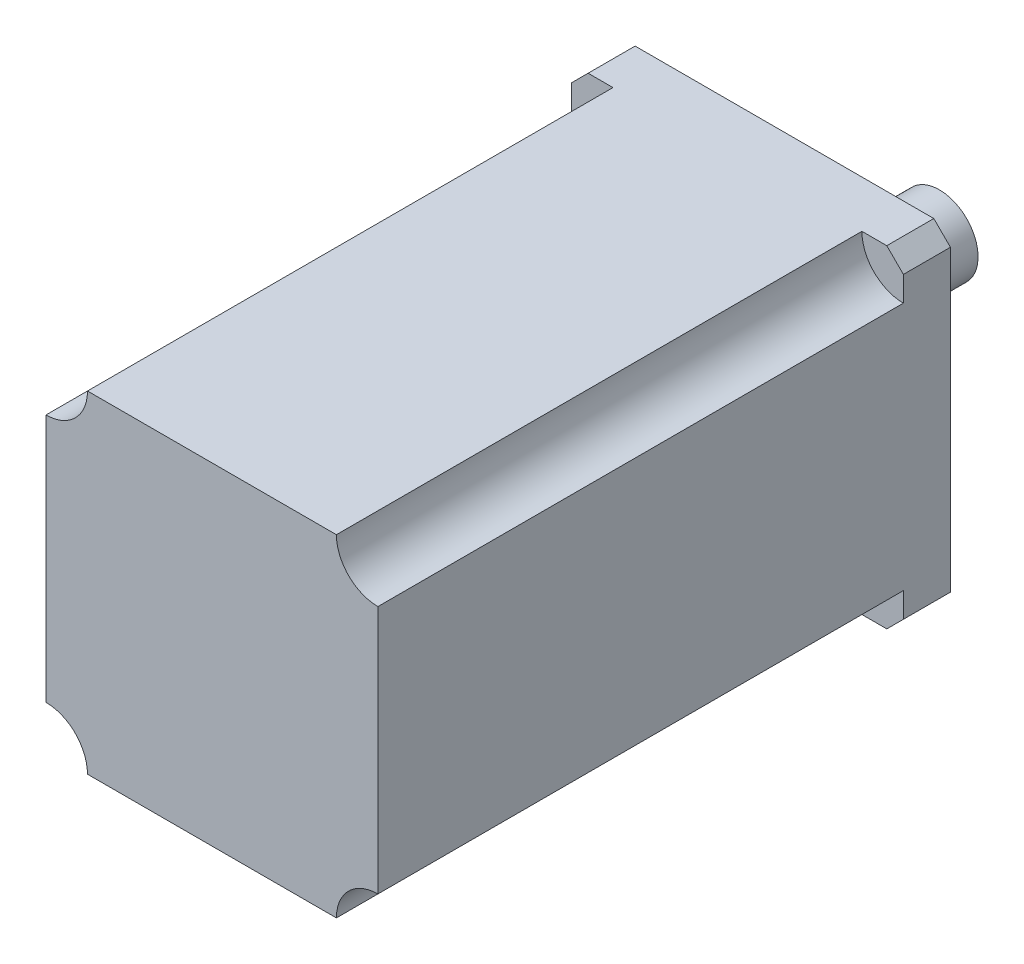
ISO-10303-21;
HEADER;
FILE_DESCRIPTION(('STEP AP214'),'2;1');
FILE_NAME('part.step','',(''),(''),'','','');
FILE_SCHEMA(('AUTOMOTIVE_DESIGN { 1 0 10303 214 1 1 1 1 }'));
ENDSEC;
DATA;
#1=APPLICATION_CONTEXT('core data for automotive mechanical design processes');
#2=APPLICATION_PROTOCOL_DEFINITION('international standard','automotive_design',2000,#1);
#3=PRODUCT_CONTEXT('',#1,'mechanical');
#4=PRODUCT('Part','Part','',(#3));
#5=PRODUCT_RELATED_PRODUCT_CATEGORY('part','',(#4));
#6=PRODUCT_DEFINITION_FORMATION('','',#4);
#7=PRODUCT_DEFINITION_CONTEXT('part definition',#1,'design');
#8=PRODUCT_DEFINITION('design','',#6,#7);
#9=PRODUCT_DEFINITION_SHAPE('','',#8);
#10=(LENGTH_UNIT() NAMED_UNIT(*) SI_UNIT(.MILLI.,.METRE.));
#11=(NAMED_UNIT(*) PLANE_ANGLE_UNIT() SI_UNIT($,.RADIAN.));
#12=(NAMED_UNIT(*) SI_UNIT($,.STERADIAN.) SOLID_ANGLE_UNIT());
#13=UNCERTAINTY_MEASURE_WITH_UNIT(LENGTH_MEASURE(1.E-05),#10,'distance_accuracy_value','');
#14=(GEOMETRIC_REPRESENTATION_CONTEXT(3) GLOBAL_UNCERTAINTY_ASSIGNED_CONTEXT((#13)) GLOBAL_UNIT_ASSIGNED_CONTEXT((#10,
#11,#12)) REPRESENTATION_CONTEXT('',''));
#15=CARTESIAN_POINT('',(0.,0.,0.));
#16=DIRECTION('',(0.,0.,1.));
#17=DIRECTION('',(1.,0.,0.));
#18=AXIS2_PLACEMENT_3D('',#15,#16,#17);
#19=CARTESIAN_POINT('',(60.,0.,95.));
#20=DIRECTION('',(0.,0.,-1.));
#21=DIRECTION('',(-1.,0.,0.));
#22=AXIS2_PLACEMENT_3D('',#19,#20,#21);
#23=CYLINDRICAL_SURFACE('',#22,7.50000000000001);
#24=CARTESIAN_POINT('',(60.,0.,0.));
#25=DIRECTION('',(0.,0.,-1.));
#26=DIRECTION('',(1.,0.,0.));
#27=AXIS2_PLACEMENT_3D('',#24,#25,#26);
#28=CIRCLE('',#27,7.50000000000001);
#29=CARTESIAN_POINT('',(60.,-7.50000000000001,0.));
#30=VERTEX_POINT('',#29);
#31=CARTESIAN_POINT('',(52.5,0.,0.));
#32=VERTEX_POINT('',#31);
#33=EDGE_CURVE('E254',#30,#32,#28,.T.);
#34=ORIENTED_EDGE('',*,*,#33,.T.);
#35=DIRECTION('',(0.,0.,-1.));
#36=VECTOR('',#35,1.);
#37=CARTESIAN_POINT('',(52.5,0.,95.));
#38=LINE('',#37,#36);
#39=CARTESIAN_POINT('',(52.5,0.,95.));
#40=VERTEX_POINT('',#39);
#41=EDGE_CURVE('E189',#40,#32,#38,.T.);
#42=ORIENTED_EDGE('',*,*,#41,.F.);
#43=CARTESIAN_POINT('',(60.,0.,95.));
#44=DIRECTION('',(0.,0.,-1.));
#45=DIRECTION('',(1.,0.,0.));
#46=AXIS2_PLACEMENT_3D('',#43,#44,#45);
#47=CIRCLE('',#46,7.50000000000001);
#48=CARTESIAN_POINT('',(60.,-7.50000000000001,95.));
#49=VERTEX_POINT('',#48);
#50=EDGE_CURVE('E261',#49,#40,#47,.T.);
#51=ORIENTED_EDGE('',*,*,#50,.F.);
#52=DIRECTION('',(0.,0.,-1.));
#53=VECTOR('',#52,1.);
#54=CARTESIAN_POINT('',(60.,-7.50000000000001,95.));
#55=LINE('',#54,#53);
#56=EDGE_CURVE('E277',#49,#30,#55,.T.);
#57=ORIENTED_EDGE('',*,*,#56,.T.);
#58=EDGE_LOOP('',(#34,#42,#51,#57));
#59=FACE_BOUND('',#58,.T.);
#60=ADVANCED_FACE('F37',(#59),#23,.F.);
#61=CARTESIAN_POINT('',(7.50000000000002,0.,95.));
#62=DIRECTION('',(0.,-1.,0.));
#63=DIRECTION('',(0.,0.,-1.));
#64=AXIS2_PLACEMENT_3D('',#61,#62,#63);
#65=PLANE('',#64);
#66=DIRECTION('',(1.,0.,0.));
#67=VECTOR('',#66,1.);
#68=CARTESIAN_POINT('',(0.,0.,-8.5));
#69=LINE('',#68,#67);
#70=CARTESIAN_POINT('',(3.00000000000001,0.,-8.5));
#71=VERTEX_POINT('',#70);
#72=CARTESIAN_POINT('',(57.,0.,-8.5));
#73=VERTEX_POINT('',#72);
#74=EDGE_CURVE('E239',#71,#73,#69,.T.);
#75=ORIENTED_EDGE('',*,*,#74,.F.);
#76=DIRECTION('',(0.,0.,1.));
#77=VECTOR('',#76,1.);
#78=CARTESIAN_POINT('',(3.00000000000001,0.,95.));
#79=LINE('',#78,#77);
#80=CARTESIAN_POINT('',(3.00000000000001,0.,0.));
#81=VERTEX_POINT('',#80);
#82=EDGE_CURVE('E221',#71,#81,#79,.T.);
#83=ORIENTED_EDGE('',*,*,#82,.T.);
#84=DIRECTION('',(1.,0.,0.));
#85=VECTOR('',#84,1.);
#86=CARTESIAN_POINT('',(0.,0.,0.));
#87=LINE('',#86,#85);
#88=CARTESIAN_POINT('',(7.50000000000002,0.,0.));
#89=VERTEX_POINT('',#88);
#90=EDGE_CURVE('E228',#81,#89,#87,.T.);
#91=ORIENTED_EDGE('',*,*,#90,.T.);
#92=DIRECTION('',(0.,0.,-1.));
#93=VECTOR('',#92,1.);
#94=CARTESIAN_POINT('',(7.50000000000002,0.,95.));
#95=LINE('',#94,#93);
#96=CARTESIAN_POINT('',(7.50000000000002,0.,95.));
#97=VERTEX_POINT('',#96);
#98=EDGE_CURVE('E181',#97,#89,#95,.T.);
#99=ORIENTED_EDGE('',*,*,#98,.F.);
#100=DIRECTION('',(-1.,0.,0.));
#101=VECTOR('',#100,1.);
#102=CARTESIAN_POINT('',(7.50000000000002,0.,95.));
#103=LINE('',#102,#101);
#104=EDGE_CURVE('E264',#40,#97,#103,.T.);
#105=ORIENTED_EDGE('',*,*,#104,.F.);
#106=ORIENTED_EDGE('',*,*,#41,.T.);
#107=CARTESIAN_POINT('',(57.,0.,0.));
#108=VERTEX_POINT('',#107);
#109=EDGE_CURVE('E161',#32,#108,#87,.T.);
#110=ORIENTED_EDGE('',*,*,#109,.T.);
#111=DIRECTION('',(0.,0.,-1.));
#112=VECTOR('',#111,1.);
#113=CARTESIAN_POINT('',(57.,0.,95.));
#114=LINE('',#113,#112);
#115=EDGE_CURVE('E219',#108,#73,#114,.T.);
#116=ORIENTED_EDGE('',*,*,#115,.T.);
#117=EDGE_LOOP('',(#75,#83,#91,#99,#105,#106,#110,#116));
#118=FACE_BOUND('',#117,.T.);
#119=ADVANCED_FACE('F243',(#118),#65,.F.);
#120=CARTESIAN_POINT('',(0.,0.,95.));
#121=DIRECTION('',(0.,0.,-1.));
#122=DIRECTION('',(-1.,0.,0.));
#123=AXIS2_PLACEMENT_3D('',#120,#121,#122);
#124=CYLINDRICAL_SURFACE('',#123,7.50000000000002);
#125=CARTESIAN_POINT('',(0.,0.,0.));
#126=DIRECTION('',(0.,0.,-1.));
#127=DIRECTION('',(-1.,0.,0.));
#128=AXIS2_PLACEMENT_3D('',#125,#126,#127);
#129=CIRCLE('',#128,7.50000000000002);
#130=CARTESIAN_POINT('',(0.,-7.50000000000002,0.));
#131=VERTEX_POINT('',#130);
#132=EDGE_CURVE('E173',#89,#131,#129,.T.);
#133=ORIENTED_EDGE('',*,*,#132,.T.);
#134=DIRECTION('',(0.,0.,-1.));
#135=VECTOR('',#134,1.);
#136=CARTESIAN_POINT('',(0.,-7.50000000000002,95.));
#137=LINE('',#136,#135);
#138=CARTESIAN_POINT('',(0.,-7.50000000000002,95.));
#139=VERTEX_POINT('',#138);
#140=EDGE_CURVE('E177',#139,#131,#137,.T.);
#141=ORIENTED_EDGE('',*,*,#140,.F.);
#142=CARTESIAN_POINT('',(0.,0.,95.));
#143=DIRECTION('',(0.,0.,-1.));
#144=DIRECTION('',(-1.,0.,0.));
#145=AXIS2_PLACEMENT_3D('',#142,#143,#144);
#146=CIRCLE('',#145,7.50000000000002);
#147=EDGE_CURVE('E266',#97,#139,#146,.T.);
#148=ORIENTED_EDGE('',*,*,#147,.F.);
#149=ORIENTED_EDGE('',*,*,#98,.T.);
#150=EDGE_LOOP('',(#133,#141,#148,#149));
#151=FACE_BOUND('',#150,.T.);
#152=ADVANCED_FACE('F330',(#151),#124,.F.);
#153=CARTESIAN_POINT('',(0.,-7.50000000000001,95.));
#154=DIRECTION('',(1.,0.,0.));
#155=DIRECTION('',(0.,0.,-1.));
#156=AXIS2_PLACEMENT_3D('',#153,#154,#155);
#157=PLANE('',#156);
#158=DIRECTION('',(0.,1.,0.));
#159=VECTOR('',#158,1.);
#160=CARTESIAN_POINT('',(0.,0.,-8.5));
#161=LINE('',#160,#159);
#162=CARTESIAN_POINT('',(0.,-57.,-8.5));
#163=VERTEX_POINT('',#162);
#164=CARTESIAN_POINT('',(0.,-3.,-8.5));
#165=VERTEX_POINT('',#164);
#166=EDGE_CURVE('E241',#163,#165,#161,.T.);
#167=ORIENTED_EDGE('',*,*,#166,.F.);
#168=DIRECTION('',(0.,0.,1.));
#169=VECTOR('',#168,1.);
#170=CARTESIAN_POINT('',(0.,-57.,95.));
#171=LINE('',#170,#169);
#172=CARTESIAN_POINT('',(0.,-57.,0.));
#173=VERTEX_POINT('',#172);
#174=EDGE_CURVE('E159',#163,#173,#171,.T.);
#175=ORIENTED_EDGE('',*,*,#174,.T.);
#176=DIRECTION('',(0.,1.,0.));
#177=VECTOR('',#176,1.);
#178=CARTESIAN_POINT('',(0.,0.,0.));
#179=LINE('',#178,#177);
#180=CARTESIAN_POINT('',(0.,-52.5,0.));
#181=VERTEX_POINT('',#180);
#182=EDGE_CURVE('E150',#173,#181,#179,.T.);
#183=ORIENTED_EDGE('',*,*,#182,.T.);
#184=DIRECTION('',(0.,0.,-1.));
#185=VECTOR('',#184,1.);
#186=CARTESIAN_POINT('',(0.,-52.5,95.));
#187=LINE('',#186,#185);
#188=CARTESIAN_POINT('',(0.,-52.5,95.));
#189=VERTEX_POINT('',#188);
#190=EDGE_CURVE('E156',#189,#181,#187,.T.);
#191=ORIENTED_EDGE('',*,*,#190,.F.);
#192=DIRECTION('',(0.,-1.,0.));
#193=VECTOR('',#192,1.);
#194=CARTESIAN_POINT('',(0.,-7.50000000000001,95.));
#195=LINE('',#194,#193);
#196=EDGE_CURVE('E268',#139,#189,#195,.T.);
#197=ORIENTED_EDGE('',*,*,#196,.F.);
#198=ORIENTED_EDGE('',*,*,#140,.T.);
#199=CARTESIAN_POINT('',(0.,-3.,0.));
#200=VERTEX_POINT('',#199);
#201=EDGE_CURVE('E162',#131,#200,#179,.T.);
#202=ORIENTED_EDGE('',*,*,#201,.T.);
#203=DIRECTION('',(0.,0.,-1.));
#204=VECTOR('',#203,1.);
#205=CARTESIAN_POINT('',(0.,-3.,95.));
#206=LINE('',#205,#204);
#207=EDGE_CURVE('E214',#200,#165,#206,.T.);
#208=ORIENTED_EDGE('',*,*,#207,.T.);
#209=EDGE_LOOP('',(#167,#175,#183,#191,#197,#198,#202,#208));
#210=FACE_BOUND('',#209,.T.);
#211=ADVANCED_FACE('F153',(#210),#157,.F.);
#212=CARTESIAN_POINT('',(0.,-60.,95.));
#213=DIRECTION('',(0.,0.,-1.));
#214=DIRECTION('',(-1.,0.,0.));
#215=AXIS2_PLACEMENT_3D('',#212,#213,#214);
#216=CYLINDRICAL_SURFACE('',#215,7.50000000000001);
#217=CARTESIAN_POINT('',(0.,-60.,0.));
#218=DIRECTION('',(0.,0.,-1.));
#219=DIRECTION('',(1.,0.,0.));
#220=AXIS2_PLACEMENT_3D('',#217,#218,#219);
#221=CIRCLE('',#220,7.50000000000001);
#222=CARTESIAN_POINT('',(7.50000000000002,-60.,0.));
#223=VERTEX_POINT('',#222);
#224=EDGE_CURVE('E165',#181,#223,#221,.T.);
#225=ORIENTED_EDGE('',*,*,#224,.T.);
#226=DIRECTION('',(0.,0.,-1.));
#227=VECTOR('',#226,1.);
#228=CARTESIAN_POINT('',(7.50000000000002,-60.,95.));
#229=LINE('',#228,#227);
#230=CARTESIAN_POINT('',(7.50000000000002,-60.,95.));
#231=VERTEX_POINT('',#230);
#232=EDGE_CURVE('E178',#231,#223,#229,.T.);
#233=ORIENTED_EDGE('',*,*,#232,.F.);
#234=CARTESIAN_POINT('',(0.,-60.,95.));
#235=DIRECTION('',(0.,0.,-1.));
#236=DIRECTION('',(1.,0.,0.));
#237=AXIS2_PLACEMENT_3D('',#234,#235,#236);
#238=CIRCLE('',#237,7.50000000000001);
#239=EDGE_CURVE('E176',#189,#231,#238,.T.);
#240=ORIENTED_EDGE('',*,*,#239,.F.);
#241=ORIENTED_EDGE('',*,*,#190,.T.);
#242=EDGE_LOOP('',(#225,#233,#240,#241));
#243=FACE_BOUND('',#242,.T.);
#244=ADVANCED_FACE('F175',(#243),#216,.F.);
#245=CARTESIAN_POINT('',(7.50000000000002,-60.,95.));
#246=DIRECTION('',(0.,1.,0.));
#247=DIRECTION('',(0.,0.,1.));
#248=AXIS2_PLACEMENT_3D('',#245,#246,#247);
#249=PLANE('',#248);
#250=DIRECTION('',(-1.,0.,0.));
#251=VECTOR('',#250,1.);
#252=CARTESIAN_POINT('',(0.,-60.,-8.5));
#253=LINE('',#252,#251);
#254=CARTESIAN_POINT('',(57.,-60.,-8.5));
#255=VERTEX_POINT('',#254);
#256=CARTESIAN_POINT('',(3.00000000000002,-60.,-8.5));
#257=VERTEX_POINT('',#256);
#258=EDGE_CURVE('E247',#255,#257,#253,.T.);
#259=ORIENTED_EDGE('',*,*,#258,.F.);
#260=DIRECTION('',(0.,0.,1.));
#261=VECTOR('',#260,1.);
#262=CARTESIAN_POINT('',(57.,-60.,95.));
#263=LINE('',#262,#261);
#264=CARTESIAN_POINT('',(57.,-60.,0.));
#265=VERTEX_POINT('',#264);
#266=EDGE_CURVE('E195',#255,#265,#263,.T.);
#267=ORIENTED_EDGE('',*,*,#266,.T.);
#268=DIRECTION('',(-1.,0.,0.));
#269=VECTOR('',#268,1.);
#270=CARTESIAN_POINT('',(0.,-60.,0.));
#271=LINE('',#270,#269);
#272=CARTESIAN_POINT('',(52.5,-60.,0.));
#273=VERTEX_POINT('',#272);
#274=EDGE_CURVE('E249',#265,#273,#271,.T.);
#275=ORIENTED_EDGE('',*,*,#274,.T.);
#276=DIRECTION('',(0.,0.,-1.));
#277=VECTOR('',#276,1.);
#278=CARTESIAN_POINT('',(52.5,-60.,95.));
#279=LINE('',#278,#277);
#280=CARTESIAN_POINT('',(52.5,-60.,95.));
#281=VERTEX_POINT('',#280);
#282=EDGE_CURVE('E183',#281,#273,#279,.T.);
#283=ORIENTED_EDGE('',*,*,#282,.F.);
#284=DIRECTION('',(1.,0.,0.));
#285=VECTOR('',#284,1.);
#286=CARTESIAN_POINT('',(7.50000000000002,-60.,95.));
#287=LINE('',#286,#285);
#288=EDGE_CURVE('E271',#231,#281,#287,.T.);
#289=ORIENTED_EDGE('',*,*,#288,.F.);
#290=ORIENTED_EDGE('',*,*,#232,.T.);
#291=CARTESIAN_POINT('',(3.00000000000002,-60.,0.));
#292=VERTEX_POINT('',#291);
#293=EDGE_CURVE('E168',#223,#292,#271,.T.);
#294=ORIENTED_EDGE('',*,*,#293,.T.);
#295=DIRECTION('',(0.,0.,-1.));
#296=VECTOR('',#295,1.);
#297=CARTESIAN_POINT('',(3.00000000000002,-60.,95.));
#298=LINE('',#297,#296);
#299=EDGE_CURVE('E193',#292,#257,#298,.T.);
#300=ORIENTED_EDGE('',*,*,#299,.T.);
#301=EDGE_LOOP('',(#259,#267,#275,#283,#289,#290,#294,#300));
#302=FACE_BOUND('',#301,.T.);
#303=ADVANCED_FACE('F297',(#302),#249,.F.);
#304=CARTESIAN_POINT('',(60.,-60.,95.));
#305=DIRECTION('',(0.,0.,-1.));
#306=DIRECTION('',(-1.,0.,0.));
#307=AXIS2_PLACEMENT_3D('',#304,#305,#306);
#308=CYLINDRICAL_SURFACE('',#307,7.50000000000002);
#309=CARTESIAN_POINT('',(60.,-60.,0.));
#310=DIRECTION('',(0.,0.,-1.));
#311=DIRECTION('',(-1.,0.,0.));
#312=AXIS2_PLACEMENT_3D('',#309,#310,#311);
#313=CIRCLE('',#312,7.50000000000002);
#314=CARTESIAN_POINT('',(60.,-52.5,0.));
#315=VERTEX_POINT('',#314);
#316=EDGE_CURVE('E172',#273,#315,#313,.T.);
#317=ORIENTED_EDGE('',*,*,#316,.T.);
#318=DIRECTION('',(0.,0.,-1.));
#319=VECTOR('',#318,1.);
#320=CARTESIAN_POINT('',(60.,-52.5,95.));
#321=LINE('',#320,#319);
#322=CARTESIAN_POINT('',(60.,-52.5,95.));
#323=VERTEX_POINT('',#322);
#324=EDGE_CURVE('E285',#323,#315,#321,.T.);
#325=ORIENTED_EDGE('',*,*,#324,.F.);
#326=CARTESIAN_POINT('',(60.,-60.,95.));
#327=DIRECTION('',(0.,0.,-1.));
#328=DIRECTION('',(-1.,0.,0.));
#329=AXIS2_PLACEMENT_3D('',#326,#327,#328);
#330=CIRCLE('',#329,7.50000000000002);
#331=EDGE_CURVE('E273',#281,#323,#330,.T.);
#332=ORIENTED_EDGE('',*,*,#331,.F.);
#333=ORIENTED_EDGE('',*,*,#282,.T.);
#334=EDGE_LOOP('',(#317,#325,#332,#333));
#335=FACE_BOUND('',#334,.T.);
#336=ADVANCED_FACE('F291',(#335),#308,.F.);
#337=CARTESIAN_POINT('',(60.,-7.50000000000001,95.));
#338=DIRECTION('',(-1.,0.,0.));
#339=DIRECTION('',(0.,0.,1.));
#340=AXIS2_PLACEMENT_3D('',#337,#338,#339);
#341=PLANE('',#340);
#342=DIRECTION('',(0.,-1.,0.));
#343=VECTOR('',#342,1.);
#344=CARTESIAN_POINT('',(60.,0.,0.));
#345=LINE('',#344,#343);
#346=CARTESIAN_POINT('',(60.,-57.,0.));
#347=VERTEX_POINT('',#346);
#348=EDGE_CURVE('E257',#315,#347,#345,.T.);
#349=ORIENTED_EDGE('',*,*,#348,.T.);
#350=DIRECTION('',(0.,0.,-1.));
#351=VECTOR('',#350,1.);
#352=CARTESIAN_POINT('',(60.,-57.,95.));
#353=LINE('',#352,#351);
#354=CARTESIAN_POINT('',(60.,-57.,-8.5));
#355=VERTEX_POINT('',#354);
#356=EDGE_CURVE('E204',#347,#355,#353,.T.);
#357=ORIENTED_EDGE('',*,*,#356,.T.);
#358=DIRECTION('',(0.,-1.,0.));
#359=VECTOR('',#358,1.);
#360=CARTESIAN_POINT('',(60.,0.,-8.5));
#361=LINE('',#360,#359);
#362=CARTESIAN_POINT('',(60.,-3.,-8.5));
#363=VERTEX_POINT('',#362);
#364=EDGE_CURVE('E245',#363,#355,#361,.T.);
#365=ORIENTED_EDGE('',*,*,#364,.F.);
#366=DIRECTION('',(0.,0.,1.));
#367=VECTOR('',#366,1.);
#368=CARTESIAN_POINT('',(60.,-3.,95.));
#369=LINE('',#368,#367);
#370=CARTESIAN_POINT('',(60.,-3.,0.));
#371=VERTEX_POINT('',#370);
#372=EDGE_CURVE('E201',#363,#371,#369,.T.);
#373=ORIENTED_EDGE('',*,*,#372,.T.);
#374=EDGE_CURVE('E258',#371,#30,#345,.T.);
#375=ORIENTED_EDGE('',*,*,#374,.T.);
#376=ORIENTED_EDGE('',*,*,#56,.F.);
#377=DIRECTION('',(0.,1.,0.));
#378=VECTOR('',#377,1.);
#379=CARTESIAN_POINT('',(60.,-7.50000000000001,95.));
#380=LINE('',#379,#378);
#381=EDGE_CURVE('E275',#323,#49,#380,.T.);
#382=ORIENTED_EDGE('',*,*,#381,.F.);
#383=ORIENTED_EDGE('',*,*,#324,.T.);
#384=EDGE_LOOP('',(#349,#357,#365,#373,#375,#376,#382,#383));
#385=FACE_BOUND('',#384,.T.);
#386=ADVANCED_FACE('F305',(#385),#341,.F.);
#387=CARTESIAN_POINT('',(60.,0.,95.));
#388=DIRECTION('',(0.,0.,1.));
#389=DIRECTION('',(1.,0.,0.));
#390=AXIS2_PLACEMENT_3D('',#387,#388,#389);
#391=PLANE('',#390);
#392=ORIENTED_EDGE('',*,*,#50,.T.);
#393=ORIENTED_EDGE('',*,*,#104,.T.);
#394=ORIENTED_EDGE('',*,*,#147,.T.);
#395=ORIENTED_EDGE('',*,*,#196,.T.);
#396=ORIENTED_EDGE('',*,*,#239,.T.);
#397=ORIENTED_EDGE('',*,*,#288,.T.);
#398=ORIENTED_EDGE('',*,*,#331,.T.);
#399=ORIENTED_EDGE('',*,*,#381,.T.);
#400=EDGE_LOOP('',(#392,#393,#394,#395,#396,#397,#398,#399));
#401=FACE_BOUND('',#400,.T.);
#402=ADVANCED_FACE('F356',(#401),#391,.T.);
#403=CARTESIAN_POINT('',(0.,0.,0.));
#404=DIRECTION('',(0.,0.,1.));
#405=DIRECTION('',(1.,0.,0.));
#406=AXIS2_PLACEMENT_3D('',#403,#404,#405);
#407=PLANE('',#406);
#408=ORIENTED_EDGE('',*,*,#374,.F.);
#409=DIRECTION('',(0.707106781186549,-0.707106781186546,0.));
#410=VECTOR('',#409,1.);
#411=CARTESIAN_POINT('',(28.4999999999999,28.5,0.));
#412=LINE('',#411,#410);
#413=EDGE_CURVE('E11',#371,#108,#412,.F.);
#414=ORIENTED_EDGE('',*,*,#413,.T.);
#415=ORIENTED_EDGE('',*,*,#109,.F.);
#416=ORIENTED_EDGE('',*,*,#33,.F.);
#417=EDGE_LOOP('',(#408,#414,#415,#416));
#418=FACE_BOUND('',#417,.T.);
#419=ADVANCED_FACE('F359',(#418),#407,.T.);
#420=ORIENTED_EDGE('',*,*,#274,.F.);
#421=DIRECTION('',(-0.707106781186546,-0.707106781186549,0.));
#422=VECTOR('',#421,1.);
#423=CARTESIAN_POINT('',(58.5000000000001,-58.4999999999999,0.));
#424=LINE('',#423,#422);
#425=EDGE_CURVE('E199',#265,#347,#424,.F.);
#426=ORIENTED_EDGE('',*,*,#425,.T.);
#427=ORIENTED_EDGE('',*,*,#348,.F.);
#428=ORIENTED_EDGE('',*,*,#316,.F.);
#429=EDGE_LOOP('',(#420,#426,#427,#428));
#430=FACE_BOUND('',#429,.T.);
#431=ADVANCED_FACE('F301',(#430),#407,.T.);
#432=ORIENTED_EDGE('',*,*,#182,.F.);
#433=DIRECTION('',(-0.707106781186549,0.707106781186546,0.));
#434=VECTOR('',#433,1.);
#435=CARTESIAN_POINT('',(-28.5,-28.5000000000001,0.));
#436=LINE('',#435,#434);
#437=EDGE_CURVE('E217',#173,#292,#436,.F.);
#438=ORIENTED_EDGE('',*,*,#437,.T.);
#439=ORIENTED_EDGE('',*,*,#293,.F.);
#440=ORIENTED_EDGE('',*,*,#224,.F.);
#441=EDGE_LOOP('',(#432,#438,#439,#440));
#442=FACE_BOUND('',#441,.T.);
#443=ADVANCED_FACE('F166',(#442),#407,.T.);
#444=ORIENTED_EDGE('',*,*,#90,.F.);
#445=DIRECTION('',(0.707106781186548,0.707106781186548,0.));
#446=VECTOR('',#445,1.);
#447=CARTESIAN_POINT('',(1.5,-1.5,0.));
#448=LINE('',#447,#446);
#449=EDGE_CURVE('E46',#81,#200,#448,.F.);
#450=ORIENTED_EDGE('',*,*,#449,.T.);
#451=ORIENTED_EDGE('',*,*,#201,.F.);
#452=ORIENTED_EDGE('',*,*,#132,.F.);
#453=EDGE_LOOP('',(#444,#450,#451,#452));
#454=FACE_BOUND('',#453,.T.);
#455=ADVANCED_FACE('F225',(#454),#407,.T.);
#456=CARTESIAN_POINT('',(0.,0.,-8.5));
#457=DIRECTION('',(0.,0.,1.));
#458=DIRECTION('',(1.,0.,0.));
#459=AXIS2_PLACEMENT_3D('',#456,#457,#458);
#460=PLANE('',#459);
#461=CARTESIAN_POINT('',(30.,-30.,-8.5));
#462=DIRECTION('',(0.,0.,-1.));
#463=DIRECTION('',(-1.,0.,0.));
#464=AXIS2_PLACEMENT_3D('',#461,#462,#463);
#465=CIRCLE('',#464,25.);
#466=CARTESIAN_POINT('',(5.,-30.,-8.5));
#467=VERTEX_POINT('',#466);
#468=EDGE_CURVE('E192',#467,#467,#465,.T.);
#469=ORIENTED_EDGE('',*,*,#468,.F.);
#470=EDGE_LOOP('',(#469));
#471=FACE_BOUND('',#470,.T.);
#472=ORIENTED_EDGE('',*,*,#364,.T.);
#473=DIRECTION('',(0.707106781186546,0.707106781186549,0.));
#474=VECTOR('',#473,1.);
#475=CARTESIAN_POINT('',(57.,-60.,-8.50000000000001));
#476=LINE('',#475,#474);
#477=EDGE_CURVE('E212',#355,#255,#476,.F.);
#478=ORIENTED_EDGE('',*,*,#477,.T.);
#479=ORIENTED_EDGE('',*,*,#258,.T.);
#480=DIRECTION('',(0.707106781186549,-0.707106781186546,0.));
#481=VECTOR('',#480,1.);
#482=CARTESIAN_POINT('',(0.,-57.,-8.50000000000001));
#483=LINE('',#482,#481);
#484=EDGE_CURVE('E210',#257,#163,#483,.F.);
#485=ORIENTED_EDGE('',*,*,#484,.T.);
#486=ORIENTED_EDGE('',*,*,#166,.T.);
#487=DIRECTION('',(-0.707106781186548,-0.707106781186548,0.));
#488=VECTOR('',#487,1.);
#489=CARTESIAN_POINT('',(3.00000000000001,0.,-8.50000000000001));
#490=LINE('',#489,#488);
#491=EDGE_CURVE('E208',#165,#71,#490,.F.);
#492=ORIENTED_EDGE('',*,*,#491,.T.);
#493=ORIENTED_EDGE('',*,*,#74,.T.);
#494=DIRECTION('',(-0.707106781186549,0.707106781186546,0.));
#495=VECTOR('',#494,1.);
#496=CARTESIAN_POINT('',(60.,-3.,-8.50000000000001));
#497=LINE('',#496,#495);
#498=EDGE_CURVE('E206',#73,#363,#497,.F.);
#499=ORIENTED_EDGE('',*,*,#498,.T.);
#500=EDGE_LOOP('',(#472,#478,#479,#485,#486,#492,#493,#499));
#501=FACE_BOUND('',#500,.T.);
#502=ADVANCED_FACE('F238',(#471,#501),#460,.F.);
#503=CARTESIAN_POINT('',(30.,-30.,-11.5));
#504=DIRECTION('',(0.,0.,1.));
#505=DIRECTION('',(1.,0.,0.));
#506=AXIS2_PLACEMENT_3D('',#503,#504,#505);
#507=CYLINDRICAL_SURFACE('',#506,25.);
#508=CARTESIAN_POINT('',(30.,-30.,-11.5));
#509=DIRECTION('',(0.,0.,-1.));
#510=DIRECTION('',(-1.,0.,0.));
#511=AXIS2_PLACEMENT_3D('',#508,#509,#510);
#512=CIRCLE('',#511,25.);
#513=CARTESIAN_POINT('',(5.,-30.,-11.5));
#514=VERTEX_POINT('',#513);
#515=EDGE_CURVE('E231',#514,#514,#512,.T.);
#516=ORIENTED_EDGE('',*,*,#515,.F.);
#517=EDGE_LOOP('',(#516));
#518=FACE_BOUND('',#517,.T.);
#519=ORIENTED_EDGE('',*,*,#468,.T.);
#520=EDGE_LOOP('',(#519));
#521=FACE_BOUND('',#520,.T.);
#522=ADVANCED_FACE('F365',(#518,#521),#507,.T.);
#523=CARTESIAN_POINT('',(30.,-30.,-11.5));
#524=DIRECTION('',(0.,0.,-1.));
#525=DIRECTION('',(-1.,0.,0.));
#526=AXIS2_PLACEMENT_3D('',#523,#524,#525);
#527=PLANE('',#526);
#528=CARTESIAN_POINT('',(30.,-30.,-11.5));
#529=DIRECTION('',(0.,0.,-1.));
#530=DIRECTION('',(-1.,0.,0.));
#531=AXIS2_PLACEMENT_3D('',#528,#529,#530);
#532=CIRCLE('',#531,7.);
#533=CARTESIAN_POINT('',(23.,-30.,-11.5));
#534=VERTEX_POINT('',#533);
#535=EDGE_CURVE('E196',#534,#534,#532,.T.);
#536=ORIENTED_EDGE('',*,*,#535,.F.);
#537=EDGE_LOOP('',(#536));
#538=FACE_BOUND('',#537,.T.);
#539=ORIENTED_EDGE('',*,*,#515,.T.);
#540=EDGE_LOOP('',(#539));
#541=FACE_BOUND('',#540,.T.);
#542=ADVANCED_FACE('F369',(#538,#541),#527,.T.);
#543=CARTESIAN_POINT('',(30.,-30.,-36.5));
#544=DIRECTION('',(0.,0.,1.));
#545=DIRECTION('',(1.,0.,0.));
#546=AXIS2_PLACEMENT_3D('',#543,#544,#545);
#547=CYLINDRICAL_SURFACE('',#546,7.);
#548=CARTESIAN_POINT('',(30.,-30.,-36.5));
#549=DIRECTION('',(0.,0.,-1.));
#550=DIRECTION('',(-1.,0.,0.));
#551=AXIS2_PLACEMENT_3D('',#548,#549,#550);
#552=CIRCLE('',#551,7.);
#553=CARTESIAN_POINT('',(23.,-30.,-36.5));
#554=VERTEX_POINT('',#553);
#555=EDGE_CURVE('E384',#554,#554,#552,.T.);
#556=ORIENTED_EDGE('',*,*,#555,.F.);
#557=EDGE_LOOP('',(#556));
#558=FACE_BOUND('',#557,.T.);
#559=ORIENTED_EDGE('',*,*,#535,.T.);
#560=EDGE_LOOP('',(#559));
#561=FACE_BOUND('',#560,.T.);
#562=ADVANCED_FACE('F373',(#558,#561),#547,.T.);
#563=CARTESIAN_POINT('',(30.,-30.,-36.5));
#564=DIRECTION('',(0.,0.,-1.));
#565=DIRECTION('',(-1.,0.,0.));
#566=AXIS2_PLACEMENT_3D('',#563,#564,#565);
#567=PLANE('',#566);
#568=ORIENTED_EDGE('',*,*,#555,.T.);
#569=EDGE_LOOP('',(#568));
#570=FACE_BOUND('',#569,.T.);
#571=ADVANCED_FACE('F321',(#570),#567,.T.);
#572=CARTESIAN_POINT('',(57.,-60.,95.));
#573=DIRECTION('',(-0.707106781186549,0.707106781186546,0.));
#574=DIRECTION('',(0.,0.,1.));
#575=AXIS2_PLACEMENT_3D('',#572,#573,#574);
#576=PLANE('',#575);
#577=ORIENTED_EDGE('',*,*,#477,.F.);
#578=ORIENTED_EDGE('',*,*,#356,.F.);
#579=ORIENTED_EDGE('',*,*,#425,.F.);
#580=ORIENTED_EDGE('',*,*,#266,.F.);
#581=EDGE_LOOP('',(#577,#578,#579,#580));
#582=FACE_BOUND('',#581,.T.);
#583=ADVANCED_FACE('F310',(#582),#576,.F.);
#584=CARTESIAN_POINT('',(0.,-57.,95.));
#585=DIRECTION('',(0.707106781186546,0.707106781186549,0.));
#586=DIRECTION('',(0.,0.,1.));
#587=AXIS2_PLACEMENT_3D('',#584,#585,#586);
#588=PLANE('',#587);
#589=ORIENTED_EDGE('',*,*,#484,.F.);
#590=ORIENTED_EDGE('',*,*,#299,.F.);
#591=ORIENTED_EDGE('',*,*,#437,.F.);
#592=ORIENTED_EDGE('',*,*,#174,.F.);
#593=EDGE_LOOP('',(#589,#590,#591,#592));
#594=FACE_BOUND('',#593,.T.);
#595=ADVANCED_FACE('F314',(#594),#588,.F.);
#596=CARTESIAN_POINT('',(3.00000000000001,0.,95.));
#597=DIRECTION('',(0.707106781186547,-0.707106781186547,0.));
#598=DIRECTION('',(0.,0.,1.));
#599=AXIS2_PLACEMENT_3D('',#596,#597,#598);
#600=PLANE('',#599);
#601=ORIENTED_EDGE('',*,*,#491,.F.);
#602=ORIENTED_EDGE('',*,*,#207,.F.);
#603=ORIENTED_EDGE('',*,*,#449,.F.);
#604=ORIENTED_EDGE('',*,*,#82,.F.);
#605=EDGE_LOOP('',(#601,#602,#603,#604));
#606=FACE_BOUND('',#605,.T.);
#607=ADVANCED_FACE('F233',(#606),#600,.F.);
#608=CARTESIAN_POINT('',(60.,-3.,95.));
#609=DIRECTION('',(-0.707106781186546,-0.707106781186549,0.));
#610=DIRECTION('',(0.,0.,1.));
#611=AXIS2_PLACEMENT_3D('',#608,#609,#610);
#612=PLANE('',#611);
#613=ORIENTED_EDGE('',*,*,#498,.F.);
#614=ORIENTED_EDGE('',*,*,#115,.F.);
#615=ORIENTED_EDGE('',*,*,#413,.F.);
#616=ORIENTED_EDGE('',*,*,#372,.F.);
#617=EDGE_LOOP('',(#613,#614,#615,#616));
#618=FACE_BOUND('',#617,.T.);
#619=ADVANCED_FACE('F40',(#618),#612,.F.);
#620=CLOSED_SHELL('',(#60,#119,#152,#211,#244,#303,#336,#386,#402,#419,#431,#443,#455,#502,#522,
#542,#562,#571,#583,#595,#607,#619));
#621=MANIFOLD_SOLID_BREP('B2',#620);
#622=ADVANCED_BREP_SHAPE_REPRESENTATION('',(#18,#621),#14);
#623=SHAPE_DEFINITION_REPRESENTATION(#9,#622);
ENDSEC;
END-ISO-10303-21;
